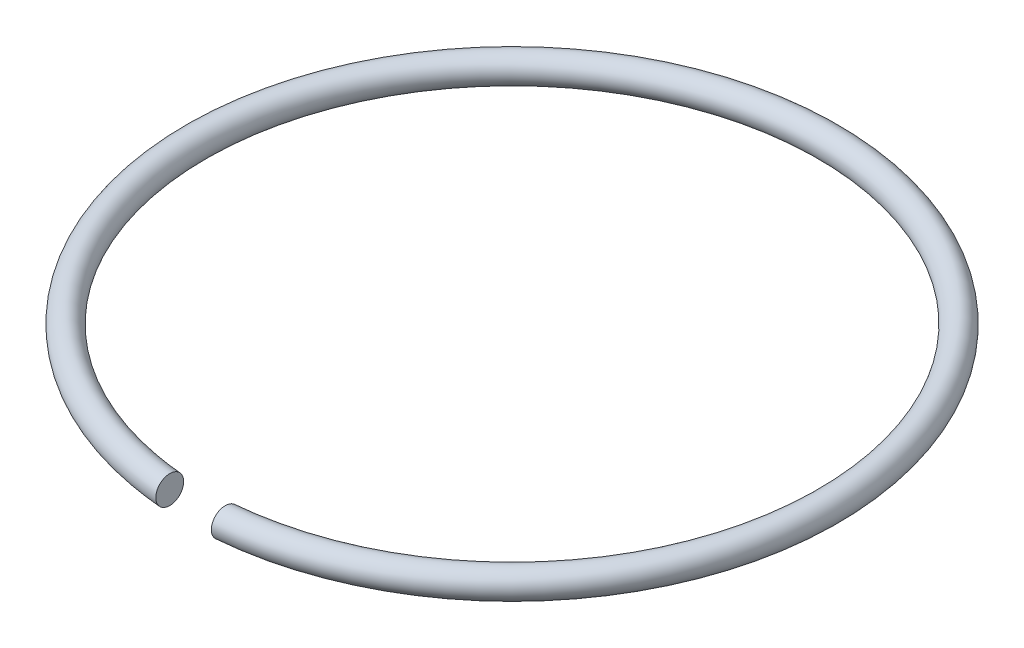
ISO-10303-21;
HEADER;
FILE_DESCRIPTION(('STEP AP214'),'2;1');
FILE_NAME('part.step','',(''),(''),'','','');
FILE_SCHEMA(('AUTOMOTIVE_DESIGN { 1 0 10303 214 1 1 1 1 }'));
ENDSEC;
DATA;
#1=APPLICATION_CONTEXT('core data for automotive mechanical design processes');
#2=APPLICATION_PROTOCOL_DEFINITION('international standard','automotive_design',2000,#1);
#3=PRODUCT_CONTEXT('',#1,'mechanical');
#4=PRODUCT('Part','Part','',(#3));
#5=PRODUCT_RELATED_PRODUCT_CATEGORY('part','',(#4));
#6=PRODUCT_DEFINITION_FORMATION('','',#4);
#7=PRODUCT_DEFINITION_CONTEXT('part definition',#1,'design');
#8=PRODUCT_DEFINITION('design','',#6,#7);
#9=PRODUCT_DEFINITION_SHAPE('','',#8);
#10=(LENGTH_UNIT() NAMED_UNIT(*) SI_UNIT(.MILLI.,.METRE.));
#11=(NAMED_UNIT(*) PLANE_ANGLE_UNIT() SI_UNIT($,.RADIAN.));
#12=(NAMED_UNIT(*) SI_UNIT($,.STERADIAN.) SOLID_ANGLE_UNIT());
#13=UNCERTAINTY_MEASURE_WITH_UNIT(LENGTH_MEASURE(1.E-05),#10,'distance_accuracy_value','');
#14=(GEOMETRIC_REPRESENTATION_CONTEXT(3) GLOBAL_UNCERTAINTY_ASSIGNED_CONTEXT((#13)) GLOBAL_UNIT_ASSIGNED_CONTEXT((#10,
#11,#12)) REPRESENTATION_CONTEXT('',''));
#15=CARTESIAN_POINT('',(0.,0.,0.));
#16=DIRECTION('',(0.,0.,1.));
#17=DIRECTION('',(1.,0.,0.));
#18=AXIS2_PLACEMENT_3D('',#15,#16,#17);
#19=CARTESIAN_POINT('',(1.016,-0.508000000000002,12.065));
#20=DIRECTION('',(1.,0.,0.));
#21=DIRECTION('',(0.,0.,-1.));
#22=AXIS2_PLACEMENT_3D('',#19,#20,#21);
#23=PLANE('',#22);
#24=CARTESIAN_POINT('',(1.016,0.,11.0021881914463));
#25=CARTESIAN_POINT('',(1.01599999999988,0.0284294254282647,11.002190583123));
#26=CARTESIAN_POINT('',(1.01599999999947,0.0568849038649454,11.0045938886173));
#27=CARTESIAN_POINT('',(1.01600000000053,0.113034958975677,11.0141531431692));
#28=CARTESIAN_POINT('',(1.01600000000202,0.140727771292777,11.0213192825623));
#29=CARTESIAN_POINT('',(1.01600000000181,0.194486496065068,11.0401909342891));
#30=CARTESIAN_POINT('',(1.01600000000012,0.220554329348488,11.051890964449));
#31=CARTESIAN_POINT('',(1.01599999999989,0.270362155211176,11.0794941722875));
#32=CARTESIAN_POINT('',(1.01600000000135,0.294101929852248,11.0953977429612));
#33=CARTESIAN_POINT('',(1.01600000000149,0.338628653416022,11.1309834630833));
#34=CARTESIAN_POINT('',(1.01600000000017,0.359410077022896,11.1506725256422));
#35=CARTESIAN_POINT('',(1.01599999999983,0.397390244534181,11.1932495679577));
#36=CARTESIAN_POINT('',(1.01600000000082,0.41458861044417,11.2161378847944));
#37=CARTESIAN_POINT('',(1.016000000001,0.444974360094845,11.2645429541088));
#38=CARTESIAN_POINT('',(1.01600000000019,0.458148375790015,11.2900680978369));
#39=CARTESIAN_POINT('',(1.01599999999981,0.480058310010507,11.3429955090002));
#40=CARTESIAN_POINT('',(1.01600000000024,0.48878842486363,11.3704001783692));
#41=CARTESIAN_POINT('',(1.01600000000045,0.501561594247735,11.4263631235798));
#42=CARTESIAN_POINT('',(1.01600000000022,0.505591237961896,11.4549244607694));
#43=CARTESIAN_POINT('',(1.01599999999978,0.508806179484768,11.5123185594703));
#44=CARTESIAN_POINT('',(1.01599999999958,0.507991437597564,11.5411513232038));
#45=CARTESIAN_POINT('',(1.01599999999981,0.501532258401634,11.5983331603043));
#46=CARTESIAN_POINT('',(1.01600000000025,0.495877574663016,11.6266810772633));
#47=CARTESIAN_POINT('',(1.01599999999975,0.479891814457477,11.6819864642457));
#48=CARTESIAN_POINT('',(1.01599999999882,0.46956681162782,11.708945689667));
#49=CARTESIAN_POINT('',(1.01599999999907,0.444534168956976,11.7607344757728));
#50=CARTESIAN_POINT('',(1.01600000000024,0.429828141336879,11.7855648155678));
#51=CARTESIAN_POINT('',(1.01599999999976,0.396445597375292,11.8323922252058));
#52=CARTESIAN_POINT('',(1.01599999999811,0.377769479197716,11.8543895788164));
#53=CARTESIAN_POINT('',(1.01599999999832,0.337033192944771,11.8948595508593));
#54=CARTESIAN_POINT('',(1.01600000000017,0.314983000662786,11.9133422108725));
#55=CARTESIAN_POINT('',(1.01599999999983,0.268084027520676,11.9463258118425));
#56=CARTESIAN_POINT('',(1.01599999999764,0.243235525411371,11.960827148901));
#57=CARTESIAN_POINT('',(1.01599999999781,0.19151509813325,11.9853982923613));
#58=CARTESIAN_POINT('',(1.01600000000016,0.164648309706877,11.995478930349));
#59=CARTESIAN_POINT('',(1.01599999999984,0.109645296007527,12.0109497517924));
#60=CARTESIAN_POINT('',(1.01599999999719,0.0815119405992061,12.0163500280875));
#61=CARTESIAN_POINT('',(1.01599999999786,0.0354962208620399,12.0212123144998));
#62=CARTESIAN_POINT('',(1.01599999999931,0.0177531633513322,12.0221464261397));
#63=CARTESIAN_POINT('',(1.01600000000111,-0.028441993150694,12.0221425635904));
#64=CARTESIAN_POINT('',(1.0160000000003,-0.0569099245710851,12.0197388273117));
#65=CARTESIAN_POINT('',(1.0159999999997,-0.113084907823847,12.0101774466869));
#66=CARTESIAN_POINT('',(1.01599999999992,-0.140790197623294,12.0030096218306));
#67=CARTESIAN_POINT('',(1.01600000000008,-0.19457392836147,11.9841320040974));
#68=CARTESIAN_POINT('',(1.01600000000002,-0.220654255485921,11.9724275955586));
#69=CARTESIAN_POINT('',(1.01599999999998,-0.270485001220956,11.9448119189907));
#70=CARTESIAN_POINT('',(1.01599999999999,-0.294235213002547,11.9289002779757));
#71=CARTESIAN_POINT('',(1.01600000000002,-0.338770097625574,11.8933010975137));
#72=CARTESIAN_POINT('',(1.01600000000002,-0.359550419129078,11.8736081147823));
#73=CARTESIAN_POINT('',(1.01599999999998,-0.397525290861644,11.8310216509776));
#74=CARTESIAN_POINT('',(1.01599999999994,-0.414719475433313,11.8081278439322));
#75=CARTESIAN_POINT('',(1.01600000000006,-0.445083848919558,11.7597251366701));
#76=CARTESIAN_POINT('',(1.01600000000023,-0.458243049736337,11.73420934383));
#77=CARTESIAN_POINT('',(1.01599999999978,-0.480124548826469,11.6813028742232));
#78=CARTESIAN_POINT('',(1.01599999999916,-0.48884105132415,11.6539098009789));
#79=CARTESIAN_POINT('',(1.01599999999915,-0.5015889124166,11.5979750126648));
#80=CARTESIAN_POINT('',(1.01599999999975,-0.505607317878985,11.5694303453432));
#81=CARTESIAN_POINT('',(1.01600000000025,-0.50880521853477,11.5120711365049));
#82=CARTESIAN_POINT('',(1.01600000000013,-0.507984651567565,11.483256591526));
#83=CARTESIAN_POINT('',(1.01599999999983,-0.50151944597182,11.426097333919));
#84=CARTESIAN_POINT('',(1.01599999999963,-0.495862235802401,11.3977540420785));
#85=CARTESIAN_POINT('',(1.01600000000037,-0.479875249908818,11.3424570637295));
#86=CARTESIAN_POINT('',(1.0160000000013,-0.469551520610067,11.3155016291558));
#87=CARTESIAN_POINT('',(1.01600000000097,-0.444517767833764,11.2637022133226));
#88=CARTESIAN_POINT('',(1.01599999999971,-0.42980666937832,11.2388587514505));
#89=CARTESIAN_POINT('',(1.01600000000029,-0.396412525354336,11.1920055012126));
#90=CARTESIAN_POINT('',(1.01600000000214,-0.377729872085696,11.1699954333159));
#91=CARTESIAN_POINT('',(1.01600000000229,-0.336975107552579,11.1294979547427));
#92=CARTESIAN_POINT('',(1.01600000000062,-0.31491241699344,11.1110010637282));
#93=CARTESIAN_POINT('',(1.01599999999938,-0.267985097978753,11.0779933019195));
#94=CARTESIAN_POINT('',(1.01599999999983,-0.24312076189516,11.063482015741));
#95=CARTESIAN_POINT('',(1.01600000000016,-0.191377294470339,11.0389029389074));
#96=CARTESIAN_POINT('',(1.01600000000005,-0.164504227622367,11.0288223589627));
#97=CARTESIAN_POINT('',(1.01599999999995,-0.10948817712879,11.0133560128469));
#98=CARTESIAN_POINT('',(1.01599999999996,-0.0813480749306568,11.0079601091308));
#99=CARTESIAN_POINT('',(1.01600000000003,-0.0353822985042012,11.0031154652608));
#100=CARTESIAN_POINT('',(1.01600000000007,-0.0176961964645014,11.0021867027218));
#101=CARTESIAN_POINT('',(1.016,0.,11.0021881914463));
#102=B_SPLINE_CURVE_WITH_KNOTS('',3,(#24,#25,#26,#27,#28,#29,#30,#31,#32,#33,#34,#35,#36,#37,
#38,#39,#40,#41,#42,#43,#44,#45,#46,#47,#48,#49,#50,#51,#52,#53,#54,#55,#56,#57,#58,#59,#60,#61,
#62,#63,#64,#65,#66,#67,#68,#69,#70,#71,#72,#73,#74,#75,#76,#77,#78,#79,#80,#81,#82,#83,#84,#85,
#86,#87,#88,#89,#90,#91,#92,#93,#94,#95,#96,#97,#98,#99,#100,#101),.UNSPECIFIED.,.T.,.F.,(4,2,2,
2,2,2,2,2,2,2,2,2,2,2,2,2,2,2,2,2,2,2,2,2,2,2,2,2,2,2,2,2,2,2,2,2,2,2,4),(0.,0.0852328090845258,
0.170648567862555,0.255961366458109,0.341282143892259,0.426760241109638,0.51224735127185,
0.598015418794374,0.683895212664837,0.770019433694663,0.856144360445442,0.942452070788964,
1.02864786130922,1.11481197080188,1.20096744289288,1.28687294119875,1.37276988967162,
1.45845518144213,1.54395523643673,1.59717997786295,1.68245028722325,1.76790340140116,
1.8532554028289,1.93861497355016,2.02409835423392,2.10959044690103,2.19531332593613,
2.28114775137678,2.36721827712732,2.45328990852741,2.53958594229618,2.62577048108598,
2.7119761538837,2.79817331546169,2.88413446150573,2.97008664517683,3.0557890707895,
3.1413055724873,3.19435963573552),.UNSPECIFIED.);
#103=CARTESIAN_POINT('',(1.016,0.,11.0021881914463));
#104=VERTEX_POINT('',#103);
#105=EDGE_CURVE('E18',#104,#104,#102,.T.);
#106=ORIENTED_EDGE('',*,*,#105,.F.);
#107=EDGE_LOOP('',(#106));
#108=FACE_BOUND('',#107,.T.);
#109=ADVANCED_FACE('F14',(#108),#23,.F.);
#110=CARTESIAN_POINT('',(-1.016,-0.508000000000002,12.065));
#111=DIRECTION('',(-1.,0.,0.));
#112=DIRECTION('',(0.,0.,1.));
#113=AXIS2_PLACEMENT_3D('',#110,#111,#112);
#114=PLANE('',#113);
#115=CARTESIAN_POINT('',(-1.016,0.,12.0221449417315));
#116=CARTESIAN_POINT('',(-1.01600000000111,0.0284419931506928,12.0221425635904));
#117=CARTESIAN_POINT('',(-1.0160000000003,0.0569099245710839,12.0197388273117));
#118=CARTESIAN_POINT('',(-1.0159999999997,0.113084907823845,12.0101774466869));
#119=CARTESIAN_POINT('',(-1.01599999999992,0.140790197623293,12.0030096218306));
#120=CARTESIAN_POINT('',(-1.01600000000008,0.194573928361469,11.9841320040974));
#121=CARTESIAN_POINT('',(-1.01600000000002,0.22065425548592,11.9724275955586));
#122=CARTESIAN_POINT('',(-1.01599999999998,0.270485001220954,11.9448119189907));
#123=CARTESIAN_POINT('',(-1.01599999999999,0.294235213002546,11.9289002779757));
#124=CARTESIAN_POINT('',(-1.01600000000001,0.338770097625573,11.8933010975137));
#125=CARTESIAN_POINT('',(-1.01600000000002,0.359550419129078,11.8736081147823));
#126=CARTESIAN_POINT('',(-1.01599999999998,0.397525290861643,11.8310216509776));
#127=CARTESIAN_POINT('',(-1.01599999999994,0.414719475433311,11.8081278439322));
#128=CARTESIAN_POINT('',(-1.01600000000006,0.445083848919557,11.7597251366701));
#129=CARTESIAN_POINT('',(-1.01600000000023,0.458243049736336,11.73420934383));
#130=CARTESIAN_POINT('',(-1.01599999999977,0.480124548826468,11.6813028742232));
#131=CARTESIAN_POINT('',(-1.01599999999915,0.488841051324149,11.6539098009789));
#132=CARTESIAN_POINT('',(-1.01599999999914,0.501588912416599,11.5979750126648));
#133=CARTESIAN_POINT('',(-1.01599999999975,0.505607317878983,11.5694303453432));
#134=CARTESIAN_POINT('',(-1.01600000000025,0.508805218534769,11.5120711365049));
#135=CARTESIAN_POINT('',(-1.01600000000013,0.507984651567564,11.483256591526));
#136=CARTESIAN_POINT('',(-1.01599999999983,0.501519445971819,11.426097333919));
#137=CARTESIAN_POINT('',(-1.01599999999963,0.4958622358024,11.3977540420785));
#138=CARTESIAN_POINT('',(-1.01600000000037,0.479875249908817,11.3424570637295));
#139=CARTESIAN_POINT('',(-1.0160000000013,0.469551520610066,11.3155016291558));
#140=CARTESIAN_POINT('',(-1.01600000000097,0.444517767833762,11.2637022133226));
#141=CARTESIAN_POINT('',(-1.01599999999971,0.429806669378319,11.2388587514505));
#142=CARTESIAN_POINT('',(-1.01600000000029,0.396412525354336,11.1920055012126));
#143=CARTESIAN_POINT('',(-1.01600000000213,0.377729872085696,11.1699954333159));
#144=CARTESIAN_POINT('',(-1.01600000000228,0.336975107552578,11.1294979547427));
#145=CARTESIAN_POINT('',(-1.01600000000061,0.314912416993439,11.1110010637282));
#146=CARTESIAN_POINT('',(-1.01599999999939,0.267985097978752,11.0779933019195));
#147=CARTESIAN_POINT('',(-1.01599999999983,0.243120761895159,11.063482015741));
#148=CARTESIAN_POINT('',(-1.01600000000017,0.191377294470338,11.0389029389074));
#149=CARTESIAN_POINT('',(-1.01600000000005,0.164504227622367,11.0288223589627));
#150=CARTESIAN_POINT('',(-1.01599999999995,0.10948817712879,11.0133560128469));
#151=CARTESIAN_POINT('',(-1.01599999999995,0.0813480749306565,11.0079601091308));
#152=CARTESIAN_POINT('',(-1.01600000000003,0.0353822985042024,11.0031154652608));
#153=CARTESIAN_POINT('',(-1.01600000000007,0.0176961964645039,11.0021867027218));
#154=CARTESIAN_POINT('',(-1.01599999999988,-0.0284294254282611,11.002190583123));
#155=CARTESIAN_POINT('',(-1.01599999999947,-0.0568849038649419,11.0045938886173));
#156=CARTESIAN_POINT('',(-1.01600000000053,-0.113034958975674,11.0141531431692));
#157=CARTESIAN_POINT('',(-1.01600000000201,-0.140727771292773,11.0213192825623));
#158=CARTESIAN_POINT('',(-1.0160000000018,-0.194486496065065,11.0401909342891));
#159=CARTESIAN_POINT('',(-1.01600000000011,-0.220554329348485,11.051890964449));
#160=CARTESIAN_POINT('',(-1.01599999999988,-0.270362155211174,11.0794941722875));
#161=CARTESIAN_POINT('',(-1.01600000000134,-0.294101929852246,11.0953977429612));
#162=CARTESIAN_POINT('',(-1.01600000000149,-0.33862865341602,11.1309834630833));
#163=CARTESIAN_POINT('',(-1.01600000000017,-0.359410077022894,11.1506725256422));
#164=CARTESIAN_POINT('',(-1.01599999999983,-0.397390244534178,11.1932495679577));
#165=CARTESIAN_POINT('',(-1.01600000000081,-0.414588610444168,11.2161378847944));
#166=CARTESIAN_POINT('',(-1.016000000001,-0.444974360094844,11.2645429541088));
#167=CARTESIAN_POINT('',(-1.01600000000019,-0.458148375790014,11.2900680978369));
#168=CARTESIAN_POINT('',(-1.01599999999981,-0.480058310010506,11.3429955090002));
#169=CARTESIAN_POINT('',(-1.01600000000024,-0.48878842486363,11.3704001783692));
#170=CARTESIAN_POINT('',(-1.01600000000044,-0.501561594247736,11.4263631235798));
#171=CARTESIAN_POINT('',(-1.01600000000022,-0.505591237961897,11.4549244607694));
#172=CARTESIAN_POINT('',(-1.01599999999978,-0.508806179484769,11.5123185594703));
#173=CARTESIAN_POINT('',(-1.01599999999958,-0.507991437597566,11.5411513232038));
#174=CARTESIAN_POINT('',(-1.01599999999981,-0.501532258401636,11.5983331603043));
#175=CARTESIAN_POINT('',(-1.01600000000025,-0.495877574663017,11.6266810772633));
#176=CARTESIAN_POINT('',(-1.01599999999975,-0.479891814457479,11.6819864642457));
#177=CARTESIAN_POINT('',(-1.01599999999882,-0.469566811627821,11.708945689667));
#178=CARTESIAN_POINT('',(-1.01599999999907,-0.444534168956978,11.7607344757728));
#179=CARTESIAN_POINT('',(-1.01600000000024,-0.429828141336881,11.7855648155678));
#180=CARTESIAN_POINT('',(-1.01599999999976,-0.396445597375296,11.8323922252058));
#181=CARTESIAN_POINT('',(-1.01599999999811,-0.37776947919772,11.8543895788164));
#182=CARTESIAN_POINT('',(-1.01599999999832,-0.337033192944776,11.8948595508593));
#183=CARTESIAN_POINT('',(-1.01600000000017,-0.314983000662791,11.9133422108725));
#184=CARTESIAN_POINT('',(-1.01599999999983,-0.268084027520681,11.9463258118425));
#185=CARTESIAN_POINT('',(-1.01599999999764,-0.243235525411376,11.960827148901));
#186=CARTESIAN_POINT('',(-1.01599999999781,-0.191515098133254,11.9853982923613));
#187=CARTESIAN_POINT('',(-1.01600000000016,-0.164648309706882,11.995478930349));
#188=CARTESIAN_POINT('',(-1.01599999999984,-0.109645296007532,12.0109497517924));
#189=CARTESIAN_POINT('',(-1.01599999999719,-0.0815119405992116,12.0163500280875));
#190=CARTESIAN_POINT('',(-1.01599999999786,-0.035496220862044,12.0212123144998));
#191=CARTESIAN_POINT('',(-1.01599999999931,-0.0177531633513348,12.0221464261397));
#192=CARTESIAN_POINT('',(-1.016,0.,12.0221449417315));
#193=B_SPLINE_CURVE_WITH_KNOTS('',3,(#115,#116,#117,#118,#119,#120,#121,#122,#123,#124,#125,
#126,#127,#128,#129,#130,#131,#132,#133,#134,#135,#136,#137,#138,#139,#140,#141,#142,#143,#144,
#145,#146,#147,#148,#149,#150,#151,#152,#153,#154,#155,#156,#157,#158,#159,#160,#161,#162,#163,
#164,#165,#166,#167,#168,#169,#170,#171,#172,#173,#174,#175,#176,#177,#178,#179,#180,#181,#182,
#183,#184,#185,#186,#187,#188,#189,#190,#191,#192),.UNSPECIFIED.,.T.,.F.,(4,2,2,2,2,2,2,2,2,2,2,
2,2,2,2,2,2,2,2,2,2,2,2,2,2,2,2,2,2,2,2,2,2,2,2,2,2,2,4),(0.,0.0852703093602989,
0.170723423538209,0.256075424965947,0.341434995687206,0.426918376370967,0.512410469038082,
0.598133348073182,0.683967773513834,0.770038299264371,0.856109930664464,0.942405964433225,
1.02859050322303,1.11479617602075,1.20099333759874,1.28695448364278,1.37290666731388,
1.45860909292655,1.54412559462435,1.59717965787257,1.68241246695709,1.76782822573512,
1.85314102433068,1.93846180176483,2.02393989898221,2.10942700914442,2.19519507666694,
2.28107487053741,2.36719909156723,2.45332401831801,2.53963172866154,2.62582751918179,
2.71199162867446,2.79814710076545,2.88405259907132,2.96994954754419,3.0556348393147,
3.1411348943093,3.19435963573552),.UNSPECIFIED.);
#194=CARTESIAN_POINT('',(-1.016,0.,12.0221449417315));
#195=VERTEX_POINT('',#194);
#196=EDGE_CURVE('E9',#195,#195,#193,.T.);
#197=ORIENTED_EDGE('',*,*,#196,.F.);
#198=EDGE_LOOP('',(#197));
#199=FACE_BOUND('',#198,.T.);
#200=ADVANCED_FACE('F32',(#199),#114,.F.);
#201=CARTESIAN_POINT('',(0.,0.,0.));
#202=DIRECTION('',(0.,1.,0.));
#203=DIRECTION('',(-1.,0.,0.));
#204=AXIS2_PLACEMENT_3D('',#201,#202,#203);
#205=TOROIDAL_SURFACE('',#204,11.557,0.508);
#206=ORIENTED_EDGE('',*,*,#196,.T.);
#207=EDGE_LOOP('',(#206));
#208=FACE_BOUND('',#207,.T.);
#209=ORIENTED_EDGE('',*,*,#105,.T.);
#210=EDGE_LOOP('',(#209));
#211=FACE_BOUND('',#210,.T.);
#212=ADVANCED_FACE('F34',(#208,#211),#205,.T.);
#213=CLOSED_SHELL('',(#109,#200,#212));
#214=MANIFOLD_SOLID_BREP('B1',#213);
#215=ADVANCED_BREP_SHAPE_REPRESENTATION('',(#18,#214),#14);
#216=SHAPE_DEFINITION_REPRESENTATION(#9,#215);
ENDSEC;
END-ISO-10303-21;
